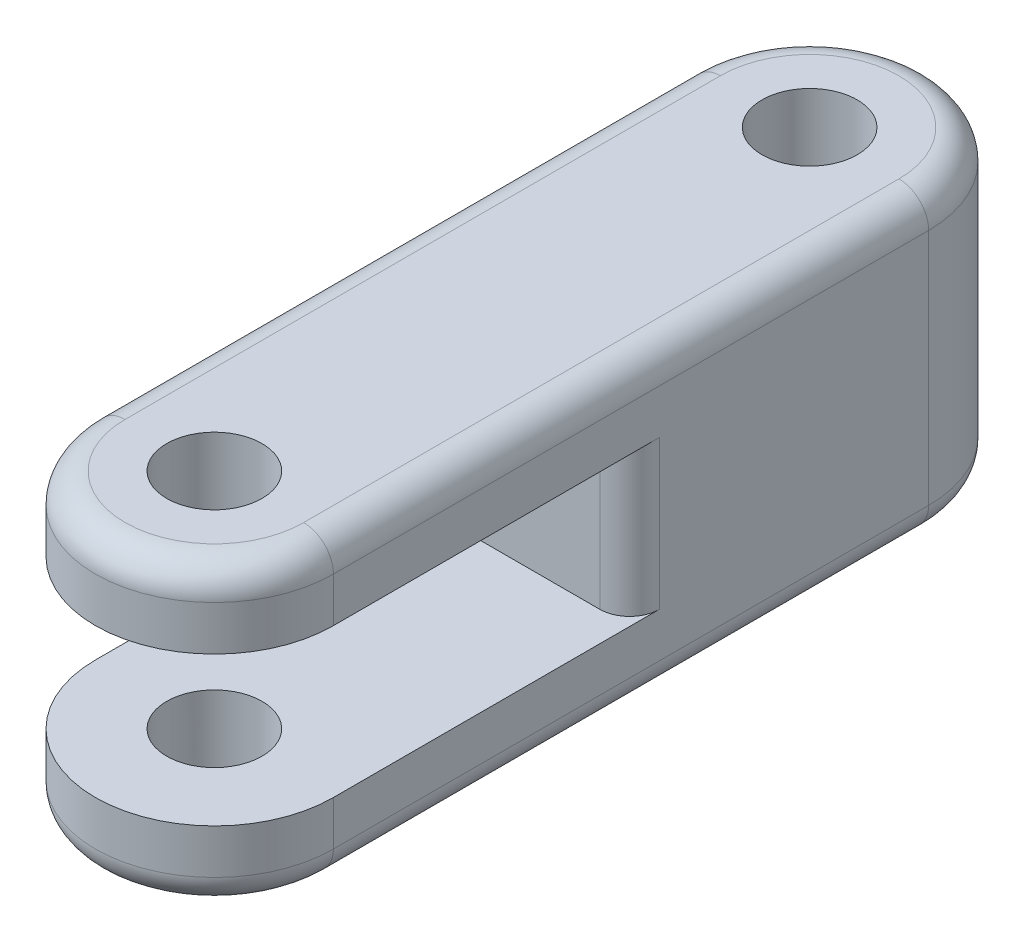
ISO-10303-21;
HEADER;
FILE_DESCRIPTION(('STEP AP214'),'2;1');
FILE_NAME('part.step','',(''),(''),'','','');
FILE_SCHEMA(('AUTOMOTIVE_DESIGN { 1 0 10303 214 1 1 1 1 }'));
ENDSEC;
DATA;
#1=APPLICATION_CONTEXT('core data for automotive mechanical design processes');
#2=APPLICATION_PROTOCOL_DEFINITION('international standard','automotive_design',2000,#1);
#3=PRODUCT_CONTEXT('',#1,'mechanical');
#4=PRODUCT('Part','Part','',(#3));
#5=PRODUCT_RELATED_PRODUCT_CATEGORY('part','',(#4));
#6=PRODUCT_DEFINITION_FORMATION('','',#4);
#7=PRODUCT_DEFINITION_CONTEXT('part definition',#1,'design');
#8=PRODUCT_DEFINITION('design','',#6,#7);
#9=PRODUCT_DEFINITION_SHAPE('','',#8);
#10=(LENGTH_UNIT() NAMED_UNIT(*) SI_UNIT(.MILLI.,.METRE.));
#11=(NAMED_UNIT(*) PLANE_ANGLE_UNIT() SI_UNIT($,.RADIAN.));
#12=(NAMED_UNIT(*) SI_UNIT($,.STERADIAN.) SOLID_ANGLE_UNIT());
#13=UNCERTAINTY_MEASURE_WITH_UNIT(LENGTH_MEASURE(1.E-05),#10,'distance_accuracy_value','');
#14=(GEOMETRIC_REPRESENTATION_CONTEXT(3) GLOBAL_UNCERTAINTY_ASSIGNED_CONTEXT((#13)) GLOBAL_UNIT_ASSIGNED_CONTEXT((#10,
#11,#12)) REPRESENTATION_CONTEXT('',''));
#15=CARTESIAN_POINT('',(0.,0.,0.));
#16=DIRECTION('',(0.,0.,1.));
#17=DIRECTION('',(1.,0.,0.));
#18=AXIS2_PLACEMENT_3D('',#15,#16,#17);
#19=CARTESIAN_POINT('',(0.,10.,0.));
#20=DIRECTION('',(0.,-1.,0.));
#21=DIRECTION('',(0.,0.,-1.));
#22=AXIS2_PLACEMENT_3D('',#19,#20,#21);
#23=CYLINDRICAL_SURFACE('',#22,1.6);
#24=CARTESIAN_POINT('',(0.,7.5,0.));
#25=DIRECTION('',(0.,1.,0.));
#26=DIRECTION('',(0.,0.,1.));
#27=AXIS2_PLACEMENT_3D('',#24,#25,#26);
#28=CIRCLE('',#27,1.6);
#29=CARTESIAN_POINT('',(0.,7.5,1.6));
#30=VERTEX_POINT('',#29);
#31=EDGE_CURVE('E353',#30,#30,#28,.T.);
#32=ORIENTED_EDGE('',*,*,#31,.F.);
#33=EDGE_LOOP('',(#32));
#34=FACE_BOUND('',#33,.T.);
#35=CARTESIAN_POINT('',(0.,10.,0.));
#36=DIRECTION('',(0.,1.,0.));
#37=DIRECTION('',(0.,0.,1.));
#38=AXIS2_PLACEMENT_3D('',#35,#36,#37);
#39=CIRCLE('',#38,1.6);
#40=CARTESIAN_POINT('',(0.,10.,1.6));
#41=VERTEX_POINT('',#40);
#42=EDGE_CURVE('E175',#41,#41,#39,.T.);
#43=ORIENTED_EDGE('',*,*,#42,.T.);
#44=EDGE_LOOP('',(#43));
#45=FACE_BOUND('',#44,.T.);
#46=ADVANCED_FACE('F40',(#34,#45),#23,.F.);
#47=CARTESIAN_POINT('',(0.,10.,0.));
#48=DIRECTION('',(0.,-1.,0.));
#49=DIRECTION('',(0.,0.,-1.));
#50=AXIS2_PLACEMENT_3D('',#47,#48,#49);
#51=CYLINDRICAL_SURFACE('',#50,4.);
#52=DIRECTION('',(0.,-1.,0.));
#53=VECTOR('',#52,1.);
#54=CARTESIAN_POINT('',(4.,10.,0.));
#55=LINE('',#54,#53);
#56=CARTESIAN_POINT('',(4.,9.,0.));
#57=VERTEX_POINT('',#56);
#58=CARTESIAN_POINT('',(4.,7.5,0.));
#59=VERTEX_POINT('',#58);
#60=EDGE_CURVE('E174',#57,#59,#55,.T.);
#61=ORIENTED_EDGE('',*,*,#60,.F.);
#62=CARTESIAN_POINT('',(0.,9.,0.));
#63=DIRECTION('',(0.,1.,0.));
#64=DIRECTION('',(0.,0.,1.));
#65=AXIS2_PLACEMENT_3D('',#62,#63,#64);
#66=CIRCLE('',#65,4.);
#67=CARTESIAN_POINT('',(-4.,9.,0.));
#68=VERTEX_POINT('',#67);
#69=EDGE_CURVE('E242',#57,#68,#66,.F.);
#70=ORIENTED_EDGE('',*,*,#69,.T.);
#71=DIRECTION('',(0.,-1.,0.));
#72=VECTOR('',#71,1.);
#73=CARTESIAN_POINT('',(-4.,10.,0.));
#74=LINE('',#73,#72);
#75=CARTESIAN_POINT('',(-4.,7.5,0.));
#76=VERTEX_POINT('',#75);
#77=EDGE_CURVE('E187',#68,#76,#74,.T.);
#78=ORIENTED_EDGE('',*,*,#77,.T.);
#79=CARTESIAN_POINT('',(0.,7.5,0.));
#80=DIRECTION('',(0.,1.,0.));
#81=DIRECTION('',(0.,0.,1.));
#82=AXIS2_PLACEMENT_3D('',#79,#80,#81);
#83=CIRCLE('',#82,4.);
#84=EDGE_CURVE('E156',#76,#59,#83,.T.);
#85=ORIENTED_EDGE('',*,*,#84,.T.);
#86=EDGE_LOOP('',(#61,#70,#78,#85));
#87=FACE_BOUND('',#86,.T.);
#88=ADVANCED_FACE('F331',(#87),#51,.T.);
#89=CARTESIAN_POINT('',(4.,10.,0.));
#90=DIRECTION('',(-1.,0.,0.));
#91=DIRECTION('',(0.,0.,1.));
#92=AXIS2_PLACEMENT_3D('',#89,#90,#91);
#93=PLANE('',#92);
#94=CARTESIAN_POINT('',(4.,2.5,0.));
#95=VERTEX_POINT('',#94);
#96=CARTESIAN_POINT('',(4.,0.999999999999999,0.));
#97=VERTEX_POINT('',#96);
#98=EDGE_CURVE('E162',#95,#97,#55,.T.);
#99=ORIENTED_EDGE('',*,*,#98,.T.);
#100=DIRECTION('',(0.,0.,-1.));
#101=VECTOR('',#100,1.);
#102=CARTESIAN_POINT('',(4.,0.999999999999999,0.));
#103=LINE('',#102,#101);
#104=CARTESIAN_POINT('',(4.,0.999999999999999,-20.));
#105=VERTEX_POINT('',#104);
#106=EDGE_CURVE('E220',#97,#105,#103,.T.);
#107=ORIENTED_EDGE('',*,*,#106,.T.);
#108=DIRECTION('',(0.,-1.,0.));
#109=VECTOR('',#108,1.);
#110=CARTESIAN_POINT('',(4.,10.,-20.));
#111=LINE('',#110,#109);
#112=CARTESIAN_POINT('',(4.,9.,-20.));
#113=VERTEX_POINT('',#112);
#114=EDGE_CURVE('E157',#113,#105,#111,.T.);
#115=ORIENTED_EDGE('',*,*,#114,.F.);
#116=DIRECTION('',(0.,0.,-1.));
#117=VECTOR('',#116,1.);
#118=CARTESIAN_POINT('',(4.,9.,0.));
#119=LINE('',#118,#117);
#120=EDGE_CURVE('E215',#113,#57,#119,.F.);
#121=ORIENTED_EDGE('',*,*,#120,.T.);
#122=ORIENTED_EDGE('',*,*,#60,.T.);
#123=DIRECTION('',(0.,0.,1.));
#124=VECTOR('',#123,1.);
#125=CARTESIAN_POINT('',(4.,7.5,-9.94968297180776));
#126=LINE('',#125,#124);
#127=CARTESIAN_POINT('',(4.,7.5,-10.9496829718078));
#128=VERTEX_POINT('',#127);
#129=EDGE_CURVE('E166',#128,#59,#126,.T.);
#130=ORIENTED_EDGE('',*,*,#129,.F.);
#131=DIRECTION('',(0.,1.,0.));
#132=VECTOR('',#131,1.);
#133=CARTESIAN_POINT('',(4.,10.,-10.9496829718078));
#134=LINE('',#133,#132);
#135=CARTESIAN_POINT('',(4.,2.5,-10.9496829718078));
#136=VERTEX_POINT('',#135);
#137=EDGE_CURVE('E163',#128,#136,#134,.F.);
#138=ORIENTED_EDGE('',*,*,#137,.T.);
#139=DIRECTION('',(0.,0.,-1.));
#140=VECTOR('',#139,1.);
#141=CARTESIAN_POINT('',(4.,2.5,-9.94968297180776));
#142=LINE('',#141,#140);
#143=EDGE_CURVE('E147',#95,#136,#142,.T.);
#144=ORIENTED_EDGE('',*,*,#143,.F.);
#145=EDGE_LOOP('',(#99,#107,#115,#121,#122,#130,#138,#144));
#146=FACE_BOUND('',#145,.T.);
#147=ADVANCED_FACE('F161',(#146),#93,.F.);
#148=CARTESIAN_POINT('',(0.,10.,-20.));
#149=DIRECTION('',(0.,-1.,0.));
#150=DIRECTION('',(0.,0.,-1.));
#151=AXIS2_PLACEMENT_3D('',#148,#149,#150);
#152=CYLINDRICAL_SURFACE('',#151,4.);
#153=ORIENTED_EDGE('',*,*,#114,.T.);
#154=CARTESIAN_POINT('',(0.,0.999999999999999,-20.));
#155=DIRECTION('',(0.,1.,0.));
#156=DIRECTION('',(0.,0.,1.));
#157=AXIS2_PLACEMENT_3D('',#154,#155,#156);
#158=CIRCLE('',#157,4.);
#159=CARTESIAN_POINT('',(-4.,0.999999999999999,-20.));
#160=VERTEX_POINT('',#159);
#161=EDGE_CURVE('E226',#105,#160,#158,.T.);
#162=ORIENTED_EDGE('',*,*,#161,.T.);
#163=DIRECTION('',(0.,-1.,0.));
#164=VECTOR('',#163,1.);
#165=CARTESIAN_POINT('',(-4.,10.,-20.));
#166=LINE('',#165,#164);
#167=CARTESIAN_POINT('',(-4.,9.,-20.));
#168=VERTEX_POINT('',#167);
#169=EDGE_CURVE('E190',#168,#160,#166,.T.);
#170=ORIENTED_EDGE('',*,*,#169,.F.);
#171=CARTESIAN_POINT('',(0.,9.,-20.));
#172=DIRECTION('',(0.,1.,0.));
#173=DIRECTION('',(0.,0.,1.));
#174=AXIS2_PLACEMENT_3D('',#171,#172,#173);
#175=CIRCLE('',#174,4.);
#176=EDGE_CURVE('E223',#168,#113,#175,.F.);
#177=ORIENTED_EDGE('',*,*,#176,.T.);
#178=EDGE_LOOP('',(#153,#162,#170,#177));
#179=FACE_BOUND('',#178,.T.);
#180=ADVANCED_FACE('F310',(#179),#152,.T.);
#181=CARTESIAN_POINT('',(-4.,10.,0.));
#182=DIRECTION('',(-1.,0.,0.));
#183=DIRECTION('',(0.,0.,1.));
#184=AXIS2_PLACEMENT_3D('',#181,#182,#183);
#185=PLANE('',#184);
#186=ORIENTED_EDGE('',*,*,#77,.F.);
#187=DIRECTION('',(0.,0.,-1.));
#188=VECTOR('',#187,1.);
#189=CARTESIAN_POINT('',(-4.,9.,0.));
#190=LINE('',#189,#188);
#191=EDGE_CURVE('E253',#68,#168,#190,.T.);
#192=ORIENTED_EDGE('',*,*,#191,.T.);
#193=ORIENTED_EDGE('',*,*,#169,.T.);
#194=DIRECTION('',(0.,0.,-1.));
#195=VECTOR('',#194,1.);
#196=CARTESIAN_POINT('',(-4.,1.,0.));
#197=LINE('',#196,#195);
#198=CARTESIAN_POINT('',(-4.,0.999999999999999,0.));
#199=VERTEX_POINT('',#198);
#200=EDGE_CURVE('E246',#160,#199,#197,.F.);
#201=ORIENTED_EDGE('',*,*,#200,.T.);
#202=CARTESIAN_POINT('',(-4.,2.5,0.));
#203=VERTEX_POINT('',#202);
#204=EDGE_CURVE('E179',#203,#199,#74,.T.);
#205=ORIENTED_EDGE('',*,*,#204,.F.);
#206=DIRECTION('',(0.,0.,1.));
#207=VECTOR('',#206,1.);
#208=CARTESIAN_POINT('',(-4.,2.5,0.));
#209=LINE('',#208,#207);
#210=CARTESIAN_POINT('',(-4.,2.5,-10.9496829718078));
#211=VERTEX_POINT('',#210);
#212=EDGE_CURVE('E150',#211,#203,#209,.T.);
#213=ORIENTED_EDGE('',*,*,#212,.F.);
#214=DIRECTION('',(0.,-1.,0.));
#215=VECTOR('',#214,1.);
#216=CARTESIAN_POINT('',(-4.,7.5,-10.9496829718078));
#217=LINE('',#216,#215);
#218=CARTESIAN_POINT('',(-4.,7.5,-10.9496829718078));
#219=VERTEX_POINT('',#218);
#220=EDGE_CURVE('E249',#211,#219,#217,.F.);
#221=ORIENTED_EDGE('',*,*,#220,.T.);
#222=DIRECTION('',(0.,0.,-1.));
#223=VECTOR('',#222,1.);
#224=CARTESIAN_POINT('',(-4.,7.5,0.));
#225=LINE('',#224,#223);
#226=EDGE_CURVE('E328',#76,#219,#225,.T.);
#227=ORIENTED_EDGE('',*,*,#226,.F.);
#228=EDGE_LOOP('',(#186,#192,#193,#201,#205,#213,#221,#227));
#229=FACE_BOUND('',#228,.T.);
#230=ADVANCED_FACE('F326',(#229),#185,.T.);
#231=CARTESIAN_POINT('',(0.,2.5,0.));
#232=DIRECTION('',(0.,-1.,0.));
#233=DIRECTION('',(0.,0.,-1.));
#234=AXIS2_PLACEMENT_3D('',#231,#232,#233);
#235=CIRCLE('',#234,1.6);
#236=CARTESIAN_POINT('',(0.,2.5,-1.6));
#237=VERTEX_POINT('',#236);
#238=EDGE_CURVE('E347',#237,#237,#235,.T.);
#239=ORIENTED_EDGE('',*,*,#238,.F.);
#240=EDGE_LOOP('',(#239));
#241=FACE_BOUND('',#240,.T.);
#242=CARTESIAN_POINT('',(0.,0.,0.));
#243=DIRECTION('',(0.,1.,0.));
#244=DIRECTION('',(0.,0.,1.));
#245=AXIS2_PLACEMENT_3D('',#242,#243,#244);
#246=CIRCLE('',#245,1.6);
#247=CARTESIAN_POINT('',(0.,0.,1.6));
#248=VERTEX_POINT('',#247);
#249=EDGE_CURVE('E185',#248,#248,#246,.T.);
#250=ORIENTED_EDGE('',*,*,#249,.F.);
#251=EDGE_LOOP('',(#250));
#252=FACE_BOUND('',#251,.T.);
#253=ADVANCED_FACE('F370',(#241,#252),#23,.F.);
#254=CARTESIAN_POINT('',(0.,10.,-20.));
#255=DIRECTION('',(0.,-1.,0.));
#256=DIRECTION('',(0.,0.,-1.));
#257=AXIS2_PLACEMENT_3D('',#254,#255,#256);
#258=CYLINDRICAL_SURFACE('',#257,1.6);
#259=CARTESIAN_POINT('',(0.,10.,-20.));
#260=DIRECTION('',(0.,1.,0.));
#261=DIRECTION('',(0.,0.,1.));
#262=AXIS2_PLACEMENT_3D('',#259,#260,#261);
#263=CIRCLE('',#262,1.6);
#264=CARTESIAN_POINT('',(0.,10.,-18.4));
#265=VERTEX_POINT('',#264);
#266=EDGE_CURVE('E181',#265,#265,#263,.T.);
#267=ORIENTED_EDGE('',*,*,#266,.T.);
#268=EDGE_LOOP('',(#267));
#269=FACE_BOUND('',#268,.T.);
#270=CARTESIAN_POINT('',(0.,0.,-20.));
#271=DIRECTION('',(0.,1.,0.));
#272=DIRECTION('',(0.,0.,1.));
#273=AXIS2_PLACEMENT_3D('',#270,#271,#272);
#274=CIRCLE('',#273,1.6);
#275=CARTESIAN_POINT('',(0.,0.,-18.4));
#276=VERTEX_POINT('',#275);
#277=EDGE_CURVE('E357',#276,#276,#274,.T.);
#278=ORIENTED_EDGE('',*,*,#277,.F.);
#279=EDGE_LOOP('',(#278));
#280=FACE_BOUND('',#279,.T.);
#281=ADVANCED_FACE('F372',(#269,#280),#258,.F.);
#282=ORIENTED_EDGE('',*,*,#204,.T.);
#283=CARTESIAN_POINT('',(0.,0.999999999999999,0.));
#284=DIRECTION('',(0.,1.,0.));
#285=DIRECTION('',(0.,0.,1.));
#286=AXIS2_PLACEMENT_3D('',#283,#284,#285);
#287=CIRCLE('',#286,4.);
#288=EDGE_CURVE('E172',#199,#97,#287,.T.);
#289=ORIENTED_EDGE('',*,*,#288,.T.);
#290=ORIENTED_EDGE('',*,*,#98,.F.);
#291=CARTESIAN_POINT('',(0.,2.5,0.));
#292=DIRECTION('',(0.,-1.,0.));
#293=DIRECTION('',(0.,0.,-1.));
#294=AXIS2_PLACEMENT_3D('',#291,#292,#293);
#295=CIRCLE('',#294,4.);
#296=EDGE_CURVE('E144',#95,#203,#295,.T.);
#297=ORIENTED_EDGE('',*,*,#296,.T.);
#298=EDGE_LOOP('',(#282,#289,#290,#297));
#299=FACE_BOUND('',#298,.T.);
#300=ADVANCED_FACE('F170',(#299),#51,.T.);
#301=CARTESIAN_POINT('',(0.,10.,0.));
#302=DIRECTION('',(0.,1.,0.));
#303=DIRECTION('',(0.,0.,1.));
#304=AXIS2_PLACEMENT_3D('',#301,#302,#303);
#305=PLANE('',#304);
#306=DIRECTION('',(0.,0.,-1.));
#307=VECTOR('',#306,1.);
#308=CARTESIAN_POINT('',(-3.,10.,0.));
#309=LINE('',#308,#307);
#310=CARTESIAN_POINT('',(-3.,10.,-20.));
#311=VERTEX_POINT('',#310);
#312=CARTESIAN_POINT('',(-3.,10.,0.));
#313=VERTEX_POINT('',#312);
#314=EDGE_CURVE('E235',#311,#313,#309,.F.);
#315=ORIENTED_EDGE('',*,*,#314,.T.);
#316=CARTESIAN_POINT('',(0.,10.,0.));
#317=DIRECTION('',(0.,1.,0.));
#318=DIRECTION('',(0.,0.,1.));
#319=AXIS2_PLACEMENT_3D('',#316,#317,#318);
#320=CIRCLE('',#319,3.);
#321=CARTESIAN_POINT('',(3.,10.,0.));
#322=VERTEX_POINT('',#321);
#323=EDGE_CURVE('E238',#313,#322,#320,.T.);
#324=ORIENTED_EDGE('',*,*,#323,.T.);
#325=DIRECTION('',(0.,0.,-1.));
#326=VECTOR('',#325,1.);
#327=CARTESIAN_POINT('',(3.,10.,-20.));
#328=LINE('',#327,#326);
#329=CARTESIAN_POINT('',(3.,10.,-20.));
#330=VERTEX_POINT('',#329);
#331=EDGE_CURVE('E229',#322,#330,#328,.T.);
#332=ORIENTED_EDGE('',*,*,#331,.T.);
#333=CARTESIAN_POINT('',(0.,10.,-20.));
#334=DIRECTION('',(0.,1.,0.));
#335=DIRECTION('',(0.,0.,1.));
#336=AXIS2_PLACEMENT_3D('',#333,#334,#335);
#337=CIRCLE('',#336,3.);
#338=EDGE_CURVE('E232',#330,#311,#337,.T.);
#339=ORIENTED_EDGE('',*,*,#338,.T.);
#340=EDGE_LOOP('',(#315,#324,#332,#339));
#341=FACE_BOUND('',#340,.T.);
#342=ORIENTED_EDGE('',*,*,#266,.F.);
#343=EDGE_LOOP('',(#342));
#344=FACE_BOUND('',#343,.T.);
#345=ORIENTED_EDGE('',*,*,#42,.F.);
#346=EDGE_LOOP('',(#345));
#347=FACE_BOUND('',#346,.T.);
#348=ADVANCED_FACE('F396',(#341,#344,#347),#305,.T.);
#349=CARTESIAN_POINT('',(0.,0.,0.));
#350=DIRECTION('',(0.,1.,0.));
#351=DIRECTION('',(0.,0.,1.));
#352=AXIS2_PLACEMENT_3D('',#349,#350,#351);
#353=PLANE('',#352);
#354=DIRECTION('',(0.,0.,-1.));
#355=VECTOR('',#354,1.);
#356=CARTESIAN_POINT('',(3.,0.,0.));
#357=LINE('',#356,#355);
#358=CARTESIAN_POINT('',(3.,0.,-20.));
#359=VERTEX_POINT('',#358);
#360=CARTESIAN_POINT('',(3.,0.,0.));
#361=VERTEX_POINT('',#360);
#362=EDGE_CURVE('E208',#359,#361,#357,.F.);
#363=ORIENTED_EDGE('',*,*,#362,.T.);
#364=CARTESIAN_POINT('',(0.,0.,0.));
#365=DIRECTION('',(0.,1.,0.));
#366=DIRECTION('',(0.,0.,1.));
#367=AXIS2_PLACEMENT_3D('',#364,#365,#366);
#368=CIRCLE('',#367,3.);
#369=CARTESIAN_POINT('',(-3.,0.,0.));
#370=VERTEX_POINT('',#369);
#371=EDGE_CURVE('E211',#361,#370,#368,.F.);
#372=ORIENTED_EDGE('',*,*,#371,.T.);
#373=DIRECTION('',(0.,0.,-1.));
#374=VECTOR('',#373,1.);
#375=CARTESIAN_POINT('',(-3.,0.,-20.));
#376=LINE('',#375,#374);
#377=CARTESIAN_POINT('',(-3.,0.,-20.));
#378=VERTEX_POINT('',#377);
#379=EDGE_CURVE('E202',#370,#378,#376,.T.);
#380=ORIENTED_EDGE('',*,*,#379,.T.);
#381=CARTESIAN_POINT('',(0.,0.,-20.));
#382=DIRECTION('',(0.,1.,0.));
#383=DIRECTION('',(0.,0.,1.));
#384=AXIS2_PLACEMENT_3D('',#381,#382,#383);
#385=CIRCLE('',#384,3.);
#386=EDGE_CURVE('E205',#378,#359,#385,.F.);
#387=ORIENTED_EDGE('',*,*,#386,.T.);
#388=EDGE_LOOP('',(#363,#372,#380,#387));
#389=FACE_BOUND('',#388,.T.);
#390=ORIENTED_EDGE('',*,*,#277,.T.);
#391=EDGE_LOOP('',(#390));
#392=FACE_BOUND('',#391,.T.);
#393=ORIENTED_EDGE('',*,*,#249,.T.);
#394=EDGE_LOOP('',(#393));
#395=FACE_BOUND('',#394,.T.);
#396=ADVANCED_FACE('F368',(#389,#392,#395),#353,.F.);
#397=CARTESIAN_POINT('',(-6.,7.5,-9.94968297180776));
#398=DIRECTION('',(0.,1.,0.));
#399=DIRECTION('',(0.,0.,1.));
#400=AXIS2_PLACEMENT_3D('',#397,#398,#399);
#401=PLANE('',#400);
#402=ORIENTED_EDGE('',*,*,#31,.T.);
#403=EDGE_LOOP('',(#402));
#404=FACE_BOUND('',#403,.T.);
#405=ORIENTED_EDGE('',*,*,#226,.T.);
#406=CARTESIAN_POINT('',(-3.,7.5,-10.9496829718078));
#407=DIRECTION('',(0.,1.,0.));
#408=DIRECTION('',(0.,0.,1.));
#409=AXIS2_PLACEMENT_3D('',#406,#407,#408);
#410=CIRCLE('',#409,1.);
#411=CARTESIAN_POINT('',(-3.,7.5,-9.94968297180776));
#412=VERTEX_POINT('',#411);
#413=EDGE_CURVE('E11',#219,#412,#410,.T.);
#414=ORIENTED_EDGE('',*,*,#413,.T.);
#415=DIRECTION('',(1.,0.,0.));
#416=VECTOR('',#415,1.);
#417=CARTESIAN_POINT('',(-6.,7.5,-9.94968297180776));
#418=LINE('',#417,#416);
#419=CARTESIAN_POINT('',(3.,7.5,-9.94968297180776));
#420=VERTEX_POINT('',#419);
#421=EDGE_CURVE('E340',#412,#420,#418,.T.);
#422=ORIENTED_EDGE('',*,*,#421,.T.);
#423=CARTESIAN_POINT('',(3.,7.5,-10.9496829718078));
#424=DIRECTION('',(0.,1.,0.));
#425=DIRECTION('',(0.,0.,1.));
#426=AXIS2_PLACEMENT_3D('',#423,#424,#425);
#427=CIRCLE('',#426,1.);
#428=EDGE_CURVE('E58',#420,#128,#427,.T.);
#429=ORIENTED_EDGE('',*,*,#428,.T.);
#430=ORIENTED_EDGE('',*,*,#129,.T.);
#431=ORIENTED_EDGE('',*,*,#84,.F.);
#432=EDGE_LOOP('',(#405,#414,#422,#429,#430,#431));
#433=FACE_BOUND('',#432,.T.);
#434=ADVANCED_FACE('F334',(#404,#433),#401,.F.);
#435=CARTESIAN_POINT('',(-6.,2.5,-9.94968297180776));
#436=DIRECTION('',(0.,0.,-1.));
#437=DIRECTION('',(-1.,0.,0.));
#438=AXIS2_PLACEMENT_3D('',#435,#436,#437);
#439=PLANE('',#438);
#440=DIRECTION('',(1.,0.,0.));
#441=VECTOR('',#440,1.);
#442=CARTESIAN_POINT('',(-6.,2.5,-9.94968297180776));
#443=LINE('',#442,#441);
#444=CARTESIAN_POINT('',(-3.,2.5,-9.94968297180776));
#445=VERTEX_POINT('',#444);
#446=CARTESIAN_POINT('',(3.,2.5,-9.94968297180776));
#447=VERTEX_POINT('',#446);
#448=EDGE_CURVE('E336',#445,#447,#443,.T.);
#449=ORIENTED_EDGE('',*,*,#448,.T.);
#450=DIRECTION('',(0.,1.,0.));
#451=VECTOR('',#450,1.);
#452=CARTESIAN_POINT('',(3.,2.5,-9.94968297180776));
#453=LINE('',#452,#451);
#454=EDGE_CURVE('E260',#447,#420,#453,.T.);
#455=ORIENTED_EDGE('',*,*,#454,.T.);
#456=ORIENTED_EDGE('',*,*,#421,.F.);
#457=DIRECTION('',(0.,-1.,0.));
#458=VECTOR('',#457,1.);
#459=CARTESIAN_POINT('',(-3.,2.5,-9.94968297180776));
#460=LINE('',#459,#458);
#461=EDGE_CURVE('E256',#412,#445,#460,.T.);
#462=ORIENTED_EDGE('',*,*,#461,.T.);
#463=EDGE_LOOP('',(#449,#455,#456,#462));
#464=FACE_BOUND('',#463,.T.);
#465=ADVANCED_FACE('F449',(#464),#439,.F.);
#466=CARTESIAN_POINT('',(-6.,2.5,-9.94968297180776));
#467=DIRECTION('',(0.,-1.,0.));
#468=DIRECTION('',(0.,0.,-1.));
#469=AXIS2_PLACEMENT_3D('',#466,#467,#468);
#470=PLANE('',#469);
#471=ORIENTED_EDGE('',*,*,#238,.T.);
#472=EDGE_LOOP('',(#471));
#473=FACE_BOUND('',#472,.T.);
#474=ORIENTED_EDGE('',*,*,#212,.T.);
#475=ORIENTED_EDGE('',*,*,#296,.F.);
#476=ORIENTED_EDGE('',*,*,#143,.T.);
#477=CARTESIAN_POINT('',(3.,2.5,-10.9496829718078));
#478=DIRECTION('',(0.,-1.,0.));
#479=DIRECTION('',(0.,0.,-1.));
#480=AXIS2_PLACEMENT_3D('',#477,#478,#479);
#481=CIRCLE('',#480,1.);
#482=EDGE_CURVE('E265',#136,#447,#481,.T.);
#483=ORIENTED_EDGE('',*,*,#482,.T.);
#484=ORIENTED_EDGE('',*,*,#448,.F.);
#485=CARTESIAN_POINT('',(-3.,2.5,-10.9496829718078));
#486=DIRECTION('',(0.,-1.,0.));
#487=DIRECTION('',(0.,0.,-1.));
#488=AXIS2_PLACEMENT_3D('',#485,#486,#487);
#489=CIRCLE('',#488,1.);
#490=EDGE_CURVE('E50',#445,#211,#489,.T.);
#491=ORIENTED_EDGE('',*,*,#490,.T.);
#492=EDGE_LOOP('',(#474,#475,#476,#483,#484,#491));
#493=FACE_BOUND('',#492,.T.);
#494=ADVANCED_FACE('F146',(#473,#493),#470,.F.);
#495=CARTESIAN_POINT('',(0.,0.999999999999999,-20.));
#496=DIRECTION('',(0.,1.,0.));
#497=DIRECTION('',(0.,0.,1.));
#498=AXIS2_PLACEMENT_3D('',#495,#496,#497);
#499=TOROIDAL_SURFACE('',#498,3.,1.);
#500=CARTESIAN_POINT('',(3.,1.,-20.));
#501=DIRECTION('',(0.,0.,1.));
#502=DIRECTION('',(1.,0.,0.));
#503=AXIS2_PLACEMENT_3D('',#500,#501,#502);
#504=CIRCLE('',#503,1.);
#505=EDGE_CURVE('E276',#359,#105,#504,.T.);
#506=ORIENTED_EDGE('',*,*,#505,.F.);
#507=ORIENTED_EDGE('',*,*,#386,.F.);
#508=CARTESIAN_POINT('',(-3.,0.999999999999999,-20.));
#509=DIRECTION('',(0.,0.,1.));
#510=DIRECTION('',(1.,0.,0.));
#511=AXIS2_PLACEMENT_3D('',#508,#509,#510);
#512=CIRCLE('',#511,1.);
#513=EDGE_CURVE('E167',#160,#378,#512,.T.);
#514=ORIENTED_EDGE('',*,*,#513,.F.);
#515=ORIENTED_EDGE('',*,*,#161,.F.);
#516=EDGE_LOOP('',(#506,#507,#514,#515));
#517=FACE_BOUND('',#516,.T.);
#518=ADVANCED_FACE('F321',(#517),#499,.T.);
#519=CARTESIAN_POINT('',(-3.,1.,0.));
#520=DIRECTION('',(0.,0.,1.));
#521=DIRECTION('',(1.,0.,0.));
#522=AXIS2_PLACEMENT_3D('',#519,#520,#521);
#523=CYLINDRICAL_SURFACE('',#522,1.);
#524=ORIENTED_EDGE('',*,*,#513,.T.);
#525=ORIENTED_EDGE('',*,*,#379,.F.);
#526=CARTESIAN_POINT('',(-3.,1.,0.));
#527=DIRECTION('',(0.,0.,1.));
#528=DIRECTION('',(1.,0.,0.));
#529=AXIS2_PLACEMENT_3D('',#526,#527,#528);
#530=CIRCLE('',#529,1.);
#531=EDGE_CURVE('E273',#199,#370,#530,.T.);
#532=ORIENTED_EDGE('',*,*,#531,.F.);
#533=ORIENTED_EDGE('',*,*,#200,.F.);
#534=EDGE_LOOP('',(#524,#525,#532,#533));
#535=FACE_BOUND('',#534,.T.);
#536=ADVANCED_FACE('F476',(#535),#523,.T.);
#537=CARTESIAN_POINT('',(3.,0.999999999999999,0.));
#538=DIRECTION('',(0.,0.,-1.));
#539=DIRECTION('',(-1.,0.,0.));
#540=AXIS2_PLACEMENT_3D('',#537,#538,#539);
#541=CYLINDRICAL_SURFACE('',#540,1.);
#542=ORIENTED_EDGE('',*,*,#505,.T.);
#543=ORIENTED_EDGE('',*,*,#106,.F.);
#544=CARTESIAN_POINT('',(3.,1.,0.));
#545=DIRECTION('',(0.,0.,1.));
#546=DIRECTION('',(1.,0.,0.));
#547=AXIS2_PLACEMENT_3D('',#544,#545,#546);
#548=CIRCLE('',#547,1.);
#549=EDGE_CURVE('E270',#361,#97,#548,.T.);
#550=ORIENTED_EDGE('',*,*,#549,.F.);
#551=ORIENTED_EDGE('',*,*,#362,.F.);
#552=EDGE_LOOP('',(#542,#543,#550,#551));
#553=FACE_BOUND('',#552,.T.);
#554=ADVANCED_FACE('F316',(#553),#541,.T.);
#555=CARTESIAN_POINT('',(0.,0.999999999999999,0.));
#556=DIRECTION('',(0.,1.,0.));
#557=DIRECTION('',(0.,0.,1.));
#558=AXIS2_PLACEMENT_3D('',#555,#556,#557);
#559=TOROIDAL_SURFACE('',#558,3.,1.);
#560=ORIENTED_EDGE('',*,*,#531,.T.);
#561=ORIENTED_EDGE('',*,*,#371,.F.);
#562=ORIENTED_EDGE('',*,*,#549,.T.);
#563=ORIENTED_EDGE('',*,*,#288,.F.);
#564=EDGE_LOOP('',(#560,#561,#562,#563));
#565=FACE_BOUND('',#564,.T.);
#566=ADVANCED_FACE('F489',(#565),#559,.T.);
#567=CARTESIAN_POINT('',(0.,9.,-20.));
#568=DIRECTION('',(0.,1.,0.));
#569=DIRECTION('',(0.,0.,1.));
#570=AXIS2_PLACEMENT_3D('',#567,#568,#569);
#571=TOROIDAL_SURFACE('',#570,3.,1.);
#572=CARTESIAN_POINT('',(3.,9.,-20.));
#573=DIRECTION('',(0.,0.,1.));
#574=DIRECTION('',(1.,0.,0.));
#575=AXIS2_PLACEMENT_3D('',#572,#573,#574);
#576=CIRCLE('',#575,1.);
#577=EDGE_CURVE('E288',#113,#330,#576,.T.);
#578=ORIENTED_EDGE('',*,*,#577,.F.);
#579=ORIENTED_EDGE('',*,*,#176,.F.);
#580=CARTESIAN_POINT('',(-3.,9.,-20.));
#581=DIRECTION('',(0.,0.,1.));
#582=DIRECTION('',(1.,0.,0.));
#583=AXIS2_PLACEMENT_3D('',#580,#581,#582);
#584=CIRCLE('',#583,1.);
#585=EDGE_CURVE('E44',#311,#168,#584,.T.);
#586=ORIENTED_EDGE('',*,*,#585,.F.);
#587=ORIENTED_EDGE('',*,*,#338,.F.);
#588=EDGE_LOOP('',(#578,#579,#586,#587));
#589=FACE_BOUND('',#588,.T.);
#590=ADVANCED_FACE('F306',(#589),#571,.T.);
#591=CARTESIAN_POINT('',(-3.,9.,0.));
#592=DIRECTION('',(0.,0.,-1.));
#593=DIRECTION('',(-1.,0.,0.));
#594=AXIS2_PLACEMENT_3D('',#591,#592,#593);
#595=CYLINDRICAL_SURFACE('',#594,1.);
#596=ORIENTED_EDGE('',*,*,#585,.T.);
#597=ORIENTED_EDGE('',*,*,#191,.F.);
#598=CARTESIAN_POINT('',(-3.,9.,0.));
#599=DIRECTION('',(0.,0.,1.));
#600=DIRECTION('',(1.,0.,0.));
#601=AXIS2_PLACEMENT_3D('',#598,#599,#600);
#602=CIRCLE('',#601,1.);
#603=EDGE_CURVE('E286',#313,#68,#602,.T.);
#604=ORIENTED_EDGE('',*,*,#603,.F.);
#605=ORIENTED_EDGE('',*,*,#314,.F.);
#606=EDGE_LOOP('',(#596,#597,#604,#605));
#607=FACE_BOUND('',#606,.T.);
#608=ADVANCED_FACE('F301',(#607),#595,.T.);
#609=CARTESIAN_POINT('',(3.,9.,0.));
#610=DIRECTION('',(0.,0.,1.));
#611=DIRECTION('',(1.,0.,0.));
#612=AXIS2_PLACEMENT_3D('',#609,#610,#611);
#613=CYLINDRICAL_SURFACE('',#612,1.);
#614=ORIENTED_EDGE('',*,*,#577,.T.);
#615=ORIENTED_EDGE('',*,*,#331,.F.);
#616=CARTESIAN_POINT('',(3.,9.,0.));
#617=DIRECTION('',(0.,0.,1.));
#618=DIRECTION('',(1.,0.,0.));
#619=AXIS2_PLACEMENT_3D('',#616,#617,#618);
#620=CIRCLE('',#619,1.);
#621=EDGE_CURVE('E283',#57,#322,#620,.T.);
#622=ORIENTED_EDGE('',*,*,#621,.F.);
#623=ORIENTED_EDGE('',*,*,#120,.F.);
#624=EDGE_LOOP('',(#614,#615,#622,#623));
#625=FACE_BOUND('',#624,.T.);
#626=ADVANCED_FACE('F509',(#625),#613,.T.);
#627=CARTESIAN_POINT('',(0.,9.,0.));
#628=DIRECTION('',(0.,1.,0.));
#629=DIRECTION('',(0.,0.,1.));
#630=AXIS2_PLACEMENT_3D('',#627,#628,#629);
#631=TOROIDAL_SURFACE('',#630,3.,1.);
#632=ORIENTED_EDGE('',*,*,#603,.T.);
#633=ORIENTED_EDGE('',*,*,#69,.F.);
#634=ORIENTED_EDGE('',*,*,#621,.T.);
#635=ORIENTED_EDGE('',*,*,#323,.F.);
#636=EDGE_LOOP('',(#632,#633,#634,#635));
#637=FACE_BOUND('',#636,.T.);
#638=ADVANCED_FACE('F516',(#637),#631,.T.);
#639=CARTESIAN_POINT('',(3.,2.5,-10.9496829718078));
#640=DIRECTION('',(0.,1.,0.));
#641=DIRECTION('',(0.,0.,1.));
#642=AXIS2_PLACEMENT_3D('',#639,#640,#641);
#643=CYLINDRICAL_SURFACE('',#642,1.);
#644=ORIENTED_EDGE('',*,*,#482,.F.);
#645=ORIENTED_EDGE('',*,*,#137,.F.);
#646=ORIENTED_EDGE('',*,*,#428,.F.);
#647=ORIENTED_EDGE('',*,*,#454,.F.);
#648=EDGE_LOOP('',(#644,#645,#646,#647));
#649=FACE_BOUND('',#648,.T.);
#650=ADVANCED_FACE('F523',(#649),#643,.T.);
#651=CARTESIAN_POINT('',(-3.,2.5,-10.9496829718078));
#652=DIRECTION('',(0.,1.,0.));
#653=DIRECTION('',(0.,0.,1.));
#654=AXIS2_PLACEMENT_3D('',#651,#652,#653);
#655=CYLINDRICAL_SURFACE('',#654,1.);
#656=ORIENTED_EDGE('',*,*,#413,.F.);
#657=ORIENTED_EDGE('',*,*,#220,.F.);
#658=ORIENTED_EDGE('',*,*,#490,.F.);
#659=ORIENTED_EDGE('',*,*,#461,.F.);
#660=EDGE_LOOP('',(#656,#657,#658,#659));
#661=FACE_BOUND('',#660,.T.);
#662=ADVANCED_FACE('F42',(#661),#655,.T.);
#663=CLOSED_SHELL('',(#46,#88,#147,#180,#230,#253,#281,#300,#348,#396,#434,#465,#494,#518,#536,
#554,#566,#590,#608,#626,#638,#650,#662));
#664=MANIFOLD_SOLID_BREP('B2',#663);
#665=ADVANCED_BREP_SHAPE_REPRESENTATION('',(#18,#664),#14);
#666=SHAPE_DEFINITION_REPRESENTATION(#9,#665);
ENDSEC;
END-ISO-10303-21;
